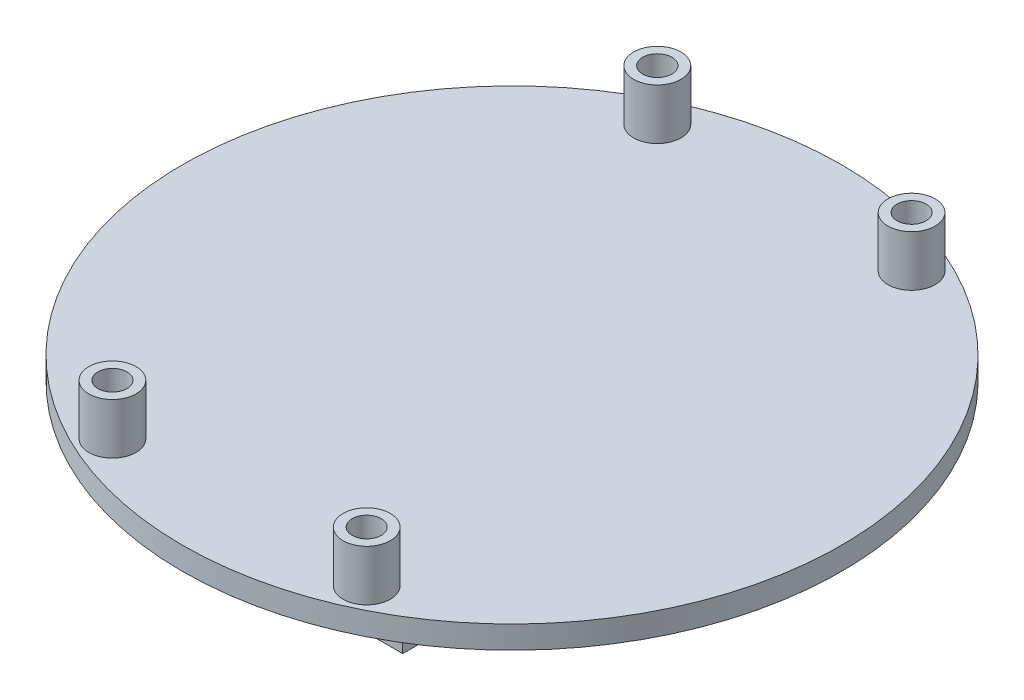
ISO-10303-21;
HEADER;
FILE_DESCRIPTION(('STEP AP214'),'2;1');
FILE_NAME('part.step','',(''),(''),'','','');
FILE_SCHEMA(('AUTOMOTIVE_DESIGN { 1 0 10303 214 1 1 1 1 }'));
ENDSEC;
DATA;
#1=APPLICATION_CONTEXT('core data for automotive mechanical design processes');
#2=APPLICATION_PROTOCOL_DEFINITION('international standard','automotive_design',2000,#1);
#3=PRODUCT_CONTEXT('',#1,'mechanical');
#4=PRODUCT('Part','Part','',(#3));
#5=PRODUCT_RELATED_PRODUCT_CATEGORY('part','',(#4));
#6=PRODUCT_DEFINITION_FORMATION('','',#4);
#7=PRODUCT_DEFINITION_CONTEXT('part definition',#1,'design');
#8=PRODUCT_DEFINITION('design','',#6,#7);
#9=PRODUCT_DEFINITION_SHAPE('','',#8);
#10=(LENGTH_UNIT() NAMED_UNIT(*) SI_UNIT(.MILLI.,.METRE.));
#11=(NAMED_UNIT(*) PLANE_ANGLE_UNIT() SI_UNIT($,.RADIAN.));
#12=(NAMED_UNIT(*) SI_UNIT($,.STERADIAN.) SOLID_ANGLE_UNIT());
#13=UNCERTAINTY_MEASURE_WITH_UNIT(LENGTH_MEASURE(1.E-05),#10,'distance_accuracy_value','');
#14=(GEOMETRIC_REPRESENTATION_CONTEXT(3) GLOBAL_UNCERTAINTY_ASSIGNED_CONTEXT((#13)) GLOBAL_UNIT_ASSIGNED_CONTEXT((#10,
#11,#12)) REPRESENTATION_CONTEXT('',''));
#15=CARTESIAN_POINT('',(0.,0.,0.));
#16=DIRECTION('',(0.,0.,1.));
#17=DIRECTION('',(1.,0.,0.));
#18=AXIS2_PLACEMENT_3D('',#15,#16,#17);
#19=CARTESIAN_POINT('',(0.,-1.25,0.));
#20=DIRECTION('',(0.,1.,0.));
#21=DIRECTION('',(0.,0.,1.));
#22=AXIS2_PLACEMENT_3D('',#19,#20,#21);
#23=PLANE('',#22);
#24=CARTESIAN_POINT('',(14.0000000003708,-1.25,-29.9999999995841));
#25=DIRECTION('',(0.,1.,0.));
#26=DIRECTION('',(0.,0.,1.));
#27=AXIS2_PLACEMENT_3D('',#24,#25,#26);
#28=CIRCLE('',#27,1.59999999976659);
#29=CARTESIAN_POINT('',(14.0000000003708,-1.25,-28.3999999998175));
#30=VERTEX_POINT('',#29);
#31=EDGE_CURVE('E48',#30,#30,#28,.T.);
#32=ORIENTED_EDGE('',*,*,#31,.T.);
#33=EDGE_LOOP('',(#32));
#34=FACE_BOUND('',#33,.T.);
#35=CARTESIAN_POINT('',(-14.0000000005569,-1.25,29.999999999983));
#36=DIRECTION('',(0.,1.,0.));
#37=DIRECTION('',(0.,0.,1.));
#38=AXIS2_PLACEMENT_3D('',#35,#36,#37);
#39=CIRCLE('',#38,1.60000000052716);
#40=CARTESIAN_POINT('',(-14.0000000005569,-1.25,31.6000000005101));
#41=VERTEX_POINT('',#40);
#42=EDGE_CURVE('E188',#41,#41,#39,.T.);
#43=ORIENTED_EDGE('',*,*,#42,.T.);
#44=EDGE_LOOP('',(#43));
#45=FACE_BOUND('',#44,.T.);
#46=CARTESIAN_POINT('',(13.9999999994432,-1.25,30.0000000004159));
#47=DIRECTION('',(0.,1.,0.));
#48=DIRECTION('',(0.,0.,1.));
#49=AXIS2_PLACEMENT_3D('',#46,#47,#48);
#50=CIRCLE('',#49,1.6000000006537);
#51=CARTESIAN_POINT('',(13.9999999994432,-1.25,31.6000000010696));
#52=VERTEX_POINT('',#51);
#53=EDGE_CURVE('E186',#52,#52,#50,.T.);
#54=ORIENTED_EDGE('',*,*,#53,.T.);
#55=EDGE_LOOP('',(#54));
#56=FACE_BOUND('',#55,.T.);
#57=CARTESIAN_POINT('',(-14.0000000000007,-1.25,-30.0000000000008));
#58=DIRECTION('',(0.,1.,0.));
#59=DIRECTION('',(0.,0.,1.));
#60=AXIS2_PLACEMENT_3D('',#57,#58,#59);
#61=CIRCLE('',#60,1.60731141973172);
#62=CARTESIAN_POINT('',(-14.0000000000007,-1.25,-28.3926885802691));
#63=VERTEX_POINT('',#62);
#64=EDGE_CURVE('E183',#63,#63,#61,.T.);
#65=ORIENTED_EDGE('',*,*,#64,.T.);
#66=EDGE_LOOP('',(#65));
#67=FACE_BOUND('',#66,.T.);
#68=CARTESIAN_POINT('',(0.,-1.25,0.));
#69=DIRECTION('',(0.,1.,0.));
#70=DIRECTION('',(0.,0.,1.));
#71=AXIS2_PLACEMENT_3D('',#68,#69,#70);
#72=CIRCLE('',#71,36.29);
#73=CARTESIAN_POINT('',(0.,-1.25,36.29));
#74=VERTEX_POINT('',#73);
#75=EDGE_CURVE('E53',#74,#74,#72,.T.);
#76=ORIENTED_EDGE('',*,*,#75,.F.);
#77=EDGE_LOOP('',(#76));
#78=FACE_BOUND('',#77,.T.);
#79=DIRECTION('',(0.,0.,-1.));
#80=VECTOR('',#79,1.);
#81=CARTESIAN_POINT('',(-14.97,-1.25,-27.005));
#82=LINE('',#81,#80);
#83=CARTESIAN_POINT('',(-14.97,-1.25,27.005));
#84=VERTEX_POINT('',#83);
#85=CARTESIAN_POINT('',(-14.97,-1.25,-27.005));
#86=VERTEX_POINT('',#85);
#87=EDGE_CURVE('E128',#84,#86,#82,.T.);
#88=ORIENTED_EDGE('',*,*,#87,.F.);
#89=DIRECTION('',(-1.,0.,0.));
#90=VECTOR('',#89,1.);
#91=CARTESIAN_POINT('',(-14.97,-1.25,27.005));
#92=LINE('',#91,#90);
#93=CARTESIAN_POINT('',(14.97,-1.25,27.005));
#94=VERTEX_POINT('',#93);
#95=EDGE_CURVE('E158',#94,#84,#92,.T.);
#96=ORIENTED_EDGE('',*,*,#95,.F.);
#97=DIRECTION('',(0.,0.,1.));
#98=VECTOR('',#97,1.);
#99=CARTESIAN_POINT('',(14.97,-1.25,-27.005));
#100=LINE('',#99,#98);
#101=CARTESIAN_POINT('',(14.97,-1.25,-27.005));
#102=VERTEX_POINT('',#101);
#103=EDGE_CURVE('E66',#102,#94,#100,.T.);
#104=ORIENTED_EDGE('',*,*,#103,.F.);
#105=DIRECTION('',(1.,0.,0.));
#106=VECTOR('',#105,1.);
#107=CARTESIAN_POINT('',(-14.97,-1.25,-27.005));
#108=LINE('',#107,#106);
#109=EDGE_CURVE('E61',#86,#102,#108,.T.);
#110=ORIENTED_EDGE('',*,*,#109,.F.);
#111=EDGE_LOOP('',(#88,#96,#104,#110));
#112=FACE_BOUND('',#111,.T.);
#113=ADVANCED_FACE('F44',(#34,#45,#56,#67,#78,#112),#23,.F.);
#114=CARTESIAN_POINT('',(0.,1.25,0.));
#115=DIRECTION('',(0.,-1.,0.));
#116=DIRECTION('',(0.,0.,-1.));
#117=AXIS2_PLACEMENT_3D('',#114,#115,#116);
#118=CYLINDRICAL_SURFACE('',#117,36.29);
#119=CARTESIAN_POINT('',(0.,1.25,0.));
#120=DIRECTION('',(0.,1.,0.));
#121=DIRECTION('',(0.,0.,1.));
#122=AXIS2_PLACEMENT_3D('',#119,#120,#121);
#123=CIRCLE('',#122,36.29);
#124=CARTESIAN_POINT('',(0.,1.25,36.29));
#125=VERTEX_POINT('',#124);
#126=EDGE_CURVE('E11',#125,#125,#123,.T.);
#127=ORIENTED_EDGE('',*,*,#126,.F.);
#128=EDGE_LOOP('',(#127));
#129=FACE_BOUND('',#128,.T.);
#130=ORIENTED_EDGE('',*,*,#75,.T.);
#131=EDGE_LOOP('',(#130));
#132=FACE_BOUND('',#131,.T.);
#133=ADVANCED_FACE('F46',(#129,#132),#118,.T.);
#134=CARTESIAN_POINT('',(0.,1.25,0.));
#135=DIRECTION('',(0.,1.,0.));
#136=DIRECTION('',(0.,0.,1.));
#137=AXIS2_PLACEMENT_3D('',#134,#135,#136);
#138=PLANE('',#137);
#139=CARTESIAN_POINT('',(13.9999999994432,1.25,30.0000000004159));
#140=DIRECTION('',(0.,1.,0.));
#141=DIRECTION('',(0.,0.,1.));
#142=AXIS2_PLACEMENT_3D('',#139,#140,#141);
#143=CIRCLE('',#142,2.60000000055617);
#144=CARTESIAN_POINT('',(13.9999999994432,1.25,32.6000000009721));
#145=VERTEX_POINT('',#144);
#146=EDGE_CURVE('E197',#145,#145,#143,.T.);
#147=ORIENTED_EDGE('',*,*,#146,.F.);
#148=EDGE_LOOP('',(#147));
#149=FACE_BOUND('',#148,.T.);
#150=CARTESIAN_POINT('',(-14.0000000005569,1.25,29.999999999983));
#151=DIRECTION('',(0.,1.,0.));
#152=DIRECTION('',(0.,0.,1.));
#153=AXIS2_PLACEMENT_3D('',#150,#151,#152);
#154=CIRCLE('',#153,2.6000000005562);
#155=CARTESIAN_POINT('',(-14.0000000005569,1.25,32.6000000005392));
#156=VERTEX_POINT('',#155);
#157=EDGE_CURVE('E208',#156,#156,#154,.T.);
#158=ORIENTED_EDGE('',*,*,#157,.F.);
#159=EDGE_LOOP('',(#158));
#160=FACE_BOUND('',#159,.T.);
#161=CARTESIAN_POINT('',(14.0000000003708,1.25,-29.9999999995841));
#162=DIRECTION('',(0.,1.,0.));
#163=DIRECTION('',(0.,0.,1.));
#164=AXIS2_PLACEMENT_3D('',#161,#162,#163);
#165=CIRCLE('',#164,2.59999999962852);
#166=CARTESIAN_POINT('',(14.0000000003708,1.25,-27.3999999999556));
#167=VERTEX_POINT('',#166);
#168=EDGE_CURVE('E217',#167,#167,#165,.T.);
#169=ORIENTED_EDGE('',*,*,#168,.F.);
#170=EDGE_LOOP('',(#169));
#171=FACE_BOUND('',#170,.T.);
#172=CARTESIAN_POINT('',(-14.0000000000007,1.25,-30.0000000000008));
#173=DIRECTION('',(0.,1.,0.));
#174=DIRECTION('',(0.,0.,1.));
#175=AXIS2_PLACEMENT_3D('',#172,#173,#174);
#176=CIRCLE('',#175,2.60731141973172);
#177=CARTESIAN_POINT('',(-14.0000000000007,1.25,-27.3926885802691));
#178=VERTEX_POINT('',#177);
#179=EDGE_CURVE('E228',#178,#178,#176,.T.);
#180=ORIENTED_EDGE('',*,*,#179,.F.);
#181=EDGE_LOOP('',(#180));
#182=FACE_BOUND('',#181,.T.);
#183=ORIENTED_EDGE('',*,*,#126,.T.);
#184=EDGE_LOOP('',(#183));
#185=FACE_BOUND('',#184,.T.);
#186=ADVANCED_FACE('F235',(#149,#160,#171,#182,#185),#138,.T.);
#187=CARTESIAN_POINT('',(0.,-6.25,0.));
#188=DIRECTION('',(0.,1.,0.));
#189=DIRECTION('',(0.,0.,1.));
#190=AXIS2_PLACEMENT_3D('',#187,#188,#189);
#191=PLANE('',#190);
#192=DIRECTION('',(0.,0.,-1.));
#193=VECTOR('',#192,1.);
#194=CARTESIAN_POINT('',(-14.97,-6.25,-27.005));
#195=LINE('',#194,#193);
#196=CARTESIAN_POINT('',(-14.97,-6.25,27.005));
#197=VERTEX_POINT('',#196);
#198=CARTESIAN_POINT('',(-14.97,-6.25,-27.005));
#199=VERTEX_POINT('',#198);
#200=EDGE_CURVE('E154',#197,#199,#195,.T.);
#201=ORIENTED_EDGE('',*,*,#200,.T.);
#202=DIRECTION('',(1.,0.,0.));
#203=VECTOR('',#202,1.);
#204=CARTESIAN_POINT('',(-14.97,-6.25,-27.005));
#205=LINE('',#204,#203);
#206=CARTESIAN_POINT('',(14.97,-6.25,-27.005));
#207=VERTEX_POINT('',#206);
#208=EDGE_CURVE('E157',#199,#207,#205,.T.);
#209=ORIENTED_EDGE('',*,*,#208,.T.);
#210=DIRECTION('',(0.,0.,1.));
#211=VECTOR('',#210,1.);
#212=CARTESIAN_POINT('',(14.97,-6.25,-27.005));
#213=LINE('',#212,#211);
#214=CARTESIAN_POINT('',(14.97,-6.25,27.005));
#215=VERTEX_POINT('',#214);
#216=EDGE_CURVE('E160',#207,#215,#213,.T.);
#217=ORIENTED_EDGE('',*,*,#216,.T.);
#218=DIRECTION('',(-1.,0.,0.));
#219=VECTOR('',#218,1.);
#220=CARTESIAN_POINT('',(-14.97,-6.25,27.005));
#221=LINE('',#220,#219);
#222=EDGE_CURVE('E162',#215,#197,#221,.T.);
#223=ORIENTED_EDGE('',*,*,#222,.T.);
#224=EDGE_LOOP('',(#201,#209,#217,#223));
#225=FACE_BOUND('',#224,.T.);
#226=DIRECTION('',(0.,0.,1.));
#227=VECTOR('',#226,1.);
#228=CARTESIAN_POINT('',(13.97,-6.25,-26.005));
#229=LINE('',#228,#227);
#230=CARTESIAN_POINT('',(13.97,-6.25,-26.005));
#231=VERTEX_POINT('',#230);
#232=CARTESIAN_POINT('',(13.97,-6.25,26.005));
#233=VERTEX_POINT('',#232);
#234=EDGE_CURVE('E110',#231,#233,#229,.T.);
#235=ORIENTED_EDGE('',*,*,#234,.F.);
#236=DIRECTION('',(1.,0.,0.));
#237=VECTOR('',#236,1.);
#238=CARTESIAN_POINT('',(-13.97,-6.25,-26.005));
#239=LINE('',#238,#237);
#240=CARTESIAN_POINT('',(-13.97,-6.25,-26.005));
#241=VERTEX_POINT('',#240);
#242=EDGE_CURVE('E136',#241,#231,#239,.T.);
#243=ORIENTED_EDGE('',*,*,#242,.F.);
#244=DIRECTION('',(0.,0.,-1.));
#245=VECTOR('',#244,1.);
#246=CARTESIAN_POINT('',(-13.97,-6.25,-26.005));
#247=LINE('',#246,#245);
#248=CARTESIAN_POINT('',(-13.97,-6.25,26.005));
#249=VERTEX_POINT('',#248);
#250=EDGE_CURVE('E134',#249,#241,#247,.T.);
#251=ORIENTED_EDGE('',*,*,#250,.F.);
#252=DIRECTION('',(-1.,0.,0.));
#253=VECTOR('',#252,1.);
#254=CARTESIAN_POINT('',(-13.97,-6.25,26.005));
#255=LINE('',#254,#253);
#256=EDGE_CURVE('E120',#233,#249,#255,.T.);
#257=ORIENTED_EDGE('',*,*,#256,.F.);
#258=EDGE_LOOP('',(#235,#243,#251,#257));
#259=FACE_BOUND('',#258,.T.);
#260=ADVANCED_FACE('F132',(#225,#259),#191,.F.);
#261=CARTESIAN_POINT('',(-14.97,-6.25,-27.005));
#262=DIRECTION('',(1.,0.,0.));
#263=DIRECTION('',(0.,0.,-1.));
#264=AXIS2_PLACEMENT_3D('',#261,#262,#263);
#265=PLANE('',#264);
#266=ORIENTED_EDGE('',*,*,#87,.T.);
#267=DIRECTION('',(0.,1.,0.));
#268=VECTOR('',#267,1.);
#269=CARTESIAN_POINT('',(-14.97,-6.25,-27.005));
#270=LINE('',#269,#268);
#271=EDGE_CURVE('E179',#199,#86,#270,.T.);
#272=ORIENTED_EDGE('',*,*,#271,.F.);
#273=ORIENTED_EDGE('',*,*,#200,.F.);
#274=DIRECTION('',(0.,1.,0.));
#275=VECTOR('',#274,1.);
#276=CARTESIAN_POINT('',(-14.97,-6.25,27.005));
#277=LINE('',#276,#275);
#278=EDGE_CURVE('E164',#197,#84,#277,.T.);
#279=ORIENTED_EDGE('',*,*,#278,.T.);
#280=EDGE_LOOP('',(#266,#272,#273,#279));
#281=FACE_BOUND('',#280,.T.);
#282=ADVANCED_FACE('F256',(#281),#265,.F.);
#283=CARTESIAN_POINT('',(-14.97,-6.25,-27.005));
#284=DIRECTION('',(0.,0.,1.));
#285=DIRECTION('',(1.,0.,0.));
#286=AXIS2_PLACEMENT_3D('',#283,#284,#285);
#287=PLANE('',#286);
#288=ORIENTED_EDGE('',*,*,#109,.T.);
#289=DIRECTION('',(0.,1.,0.));
#290=VECTOR('',#289,1.);
#291=CARTESIAN_POINT('',(14.97,-6.25,-27.005));
#292=LINE('',#291,#290);
#293=EDGE_CURVE('E176',#207,#102,#292,.T.);
#294=ORIENTED_EDGE('',*,*,#293,.F.);
#295=ORIENTED_EDGE('',*,*,#208,.F.);
#296=ORIENTED_EDGE('',*,*,#271,.T.);
#297=EDGE_LOOP('',(#288,#294,#295,#296));
#298=FACE_BOUND('',#297,.T.);
#299=ADVANCED_FACE('F263',(#298),#287,.F.);
#300=CARTESIAN_POINT('',(14.97,-6.25,-27.005));
#301=DIRECTION('',(-1.,0.,0.));
#302=DIRECTION('',(0.,0.,1.));
#303=AXIS2_PLACEMENT_3D('',#300,#301,#302);
#304=PLANE('',#303);
#305=ORIENTED_EDGE('',*,*,#103,.T.);
#306=DIRECTION('',(0.,1.,0.));
#307=VECTOR('',#306,1.);
#308=CARTESIAN_POINT('',(14.97,-6.25,27.005));
#309=LINE('',#308,#307);
#310=EDGE_CURVE('E173',#215,#94,#309,.T.);
#311=ORIENTED_EDGE('',*,*,#310,.F.);
#312=ORIENTED_EDGE('',*,*,#216,.F.);
#313=ORIENTED_EDGE('',*,*,#293,.T.);
#314=EDGE_LOOP('',(#305,#311,#312,#313));
#315=FACE_BOUND('',#314,.T.);
#316=ADVANCED_FACE('F261',(#315),#304,.F.);
#317=CARTESIAN_POINT('',(-14.97,-6.25,27.005));
#318=DIRECTION('',(0.,0.,-1.));
#319=DIRECTION('',(-1.,0.,0.));
#320=AXIS2_PLACEMENT_3D('',#317,#318,#319);
#321=PLANE('',#320);
#322=ORIENTED_EDGE('',*,*,#95,.T.);
#323=ORIENTED_EDGE('',*,*,#278,.F.);
#324=ORIENTED_EDGE('',*,*,#222,.F.);
#325=ORIENTED_EDGE('',*,*,#310,.T.);
#326=EDGE_LOOP('',(#322,#323,#324,#325));
#327=FACE_BOUND('',#326,.T.);
#328=ADVANCED_FACE('F252',(#327),#321,.F.);
#329=CARTESIAN_POINT('',(13.97,-6.25,-26.005));
#330=DIRECTION('',(-1.,0.,0.));
#331=DIRECTION('',(0.,0.,1.));
#332=AXIS2_PLACEMENT_3D('',#329,#330,#331);
#333=PLANE('',#332);
#334=DIRECTION('',(0.,0.,1.));
#335=VECTOR('',#334,1.);
#336=CARTESIAN_POINT('',(13.97,-1.25,-26.005));
#337=LINE('',#336,#335);
#338=CARTESIAN_POINT('',(13.97,-1.25,-26.005));
#339=VERTEX_POINT('',#338);
#340=CARTESIAN_POINT('',(13.97,-1.25,26.005));
#341=VERTEX_POINT('',#340);
#342=EDGE_CURVE('E141',#339,#341,#337,.T.);
#343=ORIENTED_EDGE('',*,*,#342,.F.);
#344=DIRECTION('',(0.,1.,0.));
#345=VECTOR('',#344,1.);
#346=CARTESIAN_POINT('',(13.97,-6.25,-26.005));
#347=LINE('',#346,#345);
#348=EDGE_CURVE('E116',#231,#339,#347,.T.);
#349=ORIENTED_EDGE('',*,*,#348,.F.);
#350=ORIENTED_EDGE('',*,*,#234,.T.);
#351=DIRECTION('',(0.,1.,0.));
#352=VECTOR('',#351,1.);
#353=CARTESIAN_POINT('',(13.97,-6.25,26.005));
#354=LINE('',#353,#352);
#355=EDGE_CURVE('E114',#233,#341,#354,.T.);
#356=ORIENTED_EDGE('',*,*,#355,.T.);
#357=EDGE_LOOP('',(#343,#349,#350,#356));
#358=FACE_BOUND('',#357,.T.);
#359=ADVANCED_FACE('F113',(#358),#333,.T.);
#360=CARTESIAN_POINT('',(-13.97,-6.25,26.005));
#361=DIRECTION('',(0.,0.,-1.));
#362=DIRECTION('',(-1.,0.,0.));
#363=AXIS2_PLACEMENT_3D('',#360,#361,#362);
#364=PLANE('',#363);
#365=DIRECTION('',(-1.,0.,0.));
#366=VECTOR('',#365,1.);
#367=CARTESIAN_POINT('',(-13.97,-1.25,26.005));
#368=LINE('',#367,#366);
#369=CARTESIAN_POINT('',(-13.97,-1.25,26.005));
#370=VERTEX_POINT('',#369);
#371=EDGE_CURVE('E127',#341,#370,#368,.T.);
#372=ORIENTED_EDGE('',*,*,#371,.F.);
#373=ORIENTED_EDGE('',*,*,#355,.F.);
#374=ORIENTED_EDGE('',*,*,#256,.T.);
#375=DIRECTION('',(0.,1.,0.));
#376=VECTOR('',#375,1.);
#377=CARTESIAN_POINT('',(-13.97,-6.25,26.005));
#378=LINE('',#377,#376);
#379=EDGE_CURVE('E129',#249,#370,#378,.T.);
#380=ORIENTED_EDGE('',*,*,#379,.T.);
#381=EDGE_LOOP('',(#372,#373,#374,#380));
#382=FACE_BOUND('',#381,.T.);
#383=ADVANCED_FACE('F124',(#382),#364,.T.);
#384=CARTESIAN_POINT('',(-13.97,-6.25,-26.005));
#385=DIRECTION('',(1.,0.,0.));
#386=DIRECTION('',(0.,0.,-1.));
#387=AXIS2_PLACEMENT_3D('',#384,#385,#386);
#388=PLANE('',#387);
#389=DIRECTION('',(0.,0.,-1.));
#390=VECTOR('',#389,1.);
#391=CARTESIAN_POINT('',(-13.97,-1.25,-26.005));
#392=LINE('',#391,#390);
#393=CARTESIAN_POINT('',(-13.97,-1.25,-26.005));
#394=VERTEX_POINT('',#393);
#395=EDGE_CURVE('E145',#370,#394,#392,.T.);
#396=ORIENTED_EDGE('',*,*,#395,.F.);
#397=ORIENTED_EDGE('',*,*,#379,.F.);
#398=ORIENTED_EDGE('',*,*,#250,.T.);
#399=DIRECTION('',(0.,1.,0.));
#400=VECTOR('',#399,1.);
#401=CARTESIAN_POINT('',(-13.97,-6.25,-26.005));
#402=LINE('',#401,#400);
#403=EDGE_CURVE('E151',#241,#394,#402,.T.);
#404=ORIENTED_EDGE('',*,*,#403,.T.);
#405=EDGE_LOOP('',(#396,#397,#398,#404));
#406=FACE_BOUND('',#405,.T.);
#407=ADVANCED_FACE('F283',(#406),#388,.T.);
#408=CARTESIAN_POINT('',(-13.97,-6.25,-26.005));
#409=DIRECTION('',(0.,0.,1.));
#410=DIRECTION('',(1.,0.,0.));
#411=AXIS2_PLACEMENT_3D('',#408,#409,#410);
#412=PLANE('',#411);
#413=DIRECTION('',(1.,0.,0.));
#414=VECTOR('',#413,1.);
#415=CARTESIAN_POINT('',(-13.97,-1.25,-26.005));
#416=LINE('',#415,#414);
#417=EDGE_CURVE('E121',#394,#339,#416,.T.);
#418=ORIENTED_EDGE('',*,*,#417,.F.);
#419=ORIENTED_EDGE('',*,*,#403,.F.);
#420=ORIENTED_EDGE('',*,*,#242,.T.);
#421=ORIENTED_EDGE('',*,*,#348,.T.);
#422=EDGE_LOOP('',(#418,#419,#420,#421));
#423=FACE_BOUND('',#422,.T.);
#424=ADVANCED_FACE('F275',(#423),#412,.T.);
#425=ORIENTED_EDGE('',*,*,#417,.T.);
#426=ORIENTED_EDGE('',*,*,#342,.T.);
#427=ORIENTED_EDGE('',*,*,#371,.T.);
#428=ORIENTED_EDGE('',*,*,#395,.T.);
#429=EDGE_LOOP('',(#425,#426,#427,#428));
#430=FACE_BOUND('',#429,.T.);
#431=ADVANCED_FACE('F247',(#430),#23,.F.);
#432=CARTESIAN_POINT('',(-14.0000000000007,6.84,-30.0000000000008));
#433=DIRECTION('',(0.,1.,0.));
#434=DIRECTION('',(0.,0.,1.));
#435=AXIS2_PLACEMENT_3D('',#432,#433,#434);
#436=PLANE('',#435);
#437=CARTESIAN_POINT('',(-14.0000000000007,6.84,-30.0000000000008));
#438=DIRECTION('',(0.,1.,0.));
#439=DIRECTION('',(0.,0.,1.));
#440=AXIS2_PLACEMENT_3D('',#437,#438,#439);
#441=CIRCLE('',#440,2.60731141973172);
#442=CARTESIAN_POINT('',(-14.0000000000007,6.84,-27.3926885802691));
#443=VERTEX_POINT('',#442);
#444=EDGE_CURVE('E143',#443,#443,#441,.T.);
#445=ORIENTED_EDGE('',*,*,#444,.T.);
#446=EDGE_LOOP('',(#445));
#447=FACE_BOUND('',#446,.T.);
#448=CARTESIAN_POINT('',(-14.0000000000007,6.84,-30.0000000000008));
#449=DIRECTION('',(0.,1.,0.));
#450=DIRECTION('',(0.,0.,1.));
#451=AXIS2_PLACEMENT_3D('',#448,#449,#450);
#452=CIRCLE('',#451,1.60731141973172);
#453=CARTESIAN_POINT('',(-14.0000000000007,6.84,-28.3926885802691));
#454=VERTEX_POINT('',#453);
#455=EDGE_CURVE('E225',#454,#454,#452,.T.);
#456=ORIENTED_EDGE('',*,*,#455,.F.);
#457=EDGE_LOOP('',(#456));
#458=FACE_BOUND('',#457,.T.);
#459=ADVANCED_FACE('F274',(#447,#458),#436,.T.);
#460=CARTESIAN_POINT('',(-14.0000000000007,6.84,-30.0000000000008));
#461=DIRECTION('',(0.,-1.,0.));
#462=DIRECTION('',(0.,0.,-1.));
#463=AXIS2_PLACEMENT_3D('',#460,#461,#462);
#464=CYLINDRICAL_SURFACE('',#463,2.60731141973172);
#465=ORIENTED_EDGE('',*,*,#444,.F.);
#466=EDGE_LOOP('',(#465));
#467=FACE_BOUND('',#466,.T.);
#468=ORIENTED_EDGE('',*,*,#179,.T.);
#469=EDGE_LOOP('',(#468));
#470=FACE_BOUND('',#469,.T.);
#471=ADVANCED_FACE('F233',(#467,#470),#464,.T.);
#472=CARTESIAN_POINT('',(-14.0000000000007,6.84,-30.0000000000008));
#473=DIRECTION('',(0.,-1.,0.));
#474=DIRECTION('',(0.,0.,-1.));
#475=AXIS2_PLACEMENT_3D('',#472,#473,#474);
#476=CYLINDRICAL_SURFACE('',#475,1.60731141973172);
#477=ORIENTED_EDGE('',*,*,#455,.T.);
#478=EDGE_LOOP('',(#477));
#479=FACE_BOUND('',#478,.T.);
#480=ORIENTED_EDGE('',*,*,#64,.F.);
#481=EDGE_LOOP('',(#480));
#482=FACE_BOUND('',#481,.T.);
#483=ADVANCED_FACE('F341',(#479,#482),#476,.F.);
#484=CARTESIAN_POINT('',(14.0000000003708,6.84,-29.9999999995841));
#485=DIRECTION('',(0.,1.,0.));
#486=DIRECTION('',(0.,0.,1.));
#487=AXIS2_PLACEMENT_3D('',#484,#485,#486);
#488=PLANE('',#487);
#489=CARTESIAN_POINT('',(14.0000000003708,6.84,-29.9999999995841));
#490=DIRECTION('',(0.,1.,0.));
#491=DIRECTION('',(0.,0.,1.));
#492=AXIS2_PLACEMENT_3D('',#489,#490,#491);
#493=CIRCLE('',#492,2.59999999962852);
#494=CARTESIAN_POINT('',(14.0000000003708,6.84,-27.3999999999556));
#495=VERTEX_POINT('',#494);
#496=EDGE_CURVE('E216',#495,#495,#493,.T.);
#497=ORIENTED_EDGE('',*,*,#496,.T.);
#498=EDGE_LOOP('',(#497));
#499=FACE_BOUND('',#498,.T.);
#500=CARTESIAN_POINT('',(14.0000000003708,6.84,-29.9999999995841));
#501=DIRECTION('',(0.,1.,0.));
#502=DIRECTION('',(0.,0.,1.));
#503=AXIS2_PLACEMENT_3D('',#500,#501,#502);
#504=CIRCLE('',#503,1.59999999976659);
#505=CARTESIAN_POINT('',(14.0000000003708,6.84,-28.3999999998175));
#506=VERTEX_POINT('',#505);
#507=EDGE_CURVE('E220',#506,#506,#504,.T.);
#508=ORIENTED_EDGE('',*,*,#507,.F.);
#509=EDGE_LOOP('',(#508));
#510=FACE_BOUND('',#509,.T.);
#511=ADVANCED_FACE('F352',(#499,#510),#488,.T.);
#512=CARTESIAN_POINT('',(14.0000000003708,6.84,-29.9999999995841));
#513=DIRECTION('',(0.,-1.,0.));
#514=DIRECTION('',(0.,0.,-1.));
#515=AXIS2_PLACEMENT_3D('',#512,#513,#514);
#516=CYLINDRICAL_SURFACE('',#515,2.59999999962852);
#517=ORIENTED_EDGE('',*,*,#496,.F.);
#518=EDGE_LOOP('',(#517));
#519=FACE_BOUND('',#518,.T.);
#520=ORIENTED_EDGE('',*,*,#168,.T.);
#521=EDGE_LOOP('',(#520));
#522=FACE_BOUND('',#521,.T.);
#523=ADVANCED_FACE('F364',(#519,#522),#516,.T.);
#524=CARTESIAN_POINT('',(14.0000000003708,6.84,-29.9999999995841));
#525=DIRECTION('',(0.,-1.,0.));
#526=DIRECTION('',(0.,0.,-1.));
#527=AXIS2_PLACEMENT_3D('',#524,#525,#526);
#528=CYLINDRICAL_SURFACE('',#527,1.59999999976659);
#529=ORIENTED_EDGE('',*,*,#507,.T.);
#530=EDGE_LOOP('',(#529));
#531=FACE_BOUND('',#530,.T.);
#532=ORIENTED_EDGE('',*,*,#31,.F.);
#533=EDGE_LOOP('',(#532));
#534=FACE_BOUND('',#533,.T.);
#535=ADVANCED_FACE('F374',(#531,#534),#528,.F.);
#536=CARTESIAN_POINT('',(-14.0000000005569,6.84,29.999999999983));
#537=DIRECTION('',(0.,1.,0.));
#538=DIRECTION('',(0.,0.,1.));
#539=AXIS2_PLACEMENT_3D('',#536,#537,#538);
#540=PLANE('',#539);
#541=CARTESIAN_POINT('',(-14.0000000005569,6.84,29.999999999983));
#542=DIRECTION('',(0.,1.,0.));
#543=DIRECTION('',(0.,0.,1.));
#544=AXIS2_PLACEMENT_3D('',#541,#542,#543);
#545=CIRCLE('',#544,2.6000000005562);
#546=CARTESIAN_POINT('',(-14.0000000005569,6.84,32.6000000005392));
#547=VERTEX_POINT('',#546);
#548=EDGE_CURVE('E207',#547,#547,#545,.T.);
#549=ORIENTED_EDGE('',*,*,#548,.T.);
#550=EDGE_LOOP('',(#549));
#551=FACE_BOUND('',#550,.T.);
#552=CARTESIAN_POINT('',(-14.0000000005569,6.84,29.999999999983));
#553=DIRECTION('',(0.,1.,0.));
#554=DIRECTION('',(0.,0.,1.));
#555=AXIS2_PLACEMENT_3D('',#552,#553,#554);
#556=CIRCLE('',#555,1.60000000052716);
#557=CARTESIAN_POINT('',(-14.0000000005569,6.84,31.6000000005101));
#558=VERTEX_POINT('',#557);
#559=EDGE_CURVE('E211',#558,#558,#556,.T.);
#560=ORIENTED_EDGE('',*,*,#559,.F.);
#561=EDGE_LOOP('',(#560));
#562=FACE_BOUND('',#561,.T.);
#563=ADVANCED_FACE('F385',(#551,#562),#540,.T.);
#564=CARTESIAN_POINT('',(-14.0000000005569,6.84,29.999999999983));
#565=DIRECTION('',(0.,-1.,0.));
#566=DIRECTION('',(0.,0.,-1.));
#567=AXIS2_PLACEMENT_3D('',#564,#565,#566);
#568=CYLINDRICAL_SURFACE('',#567,2.6000000005562);
#569=ORIENTED_EDGE('',*,*,#548,.F.);
#570=EDGE_LOOP('',(#569));
#571=FACE_BOUND('',#570,.T.);
#572=ORIENTED_EDGE('',*,*,#157,.T.);
#573=EDGE_LOOP('',(#572));
#574=FACE_BOUND('',#573,.T.);
#575=ADVANCED_FACE('F396',(#571,#574),#568,.T.);
#576=CARTESIAN_POINT('',(-14.0000000005569,6.84,29.999999999983));
#577=DIRECTION('',(0.,-1.,0.));
#578=DIRECTION('',(0.,0.,-1.));
#579=AXIS2_PLACEMENT_3D('',#576,#577,#578);
#580=CYLINDRICAL_SURFACE('',#579,1.60000000052716);
#581=ORIENTED_EDGE('',*,*,#559,.T.);
#582=EDGE_LOOP('',(#581));
#583=FACE_BOUND('',#582,.T.);
#584=ORIENTED_EDGE('',*,*,#42,.F.);
#585=EDGE_LOOP('',(#584));
#586=FACE_BOUND('',#585,.T.);
#587=ADVANCED_FACE('F406',(#583,#586),#580,.F.);
#588=CARTESIAN_POINT('',(13.9999999994432,6.84,30.0000000004159));
#589=DIRECTION('',(0.,1.,0.));
#590=DIRECTION('',(0.,0.,1.));
#591=AXIS2_PLACEMENT_3D('',#588,#589,#590);
#592=PLANE('',#591);
#593=CARTESIAN_POINT('',(13.9999999994432,6.84,30.0000000004159));
#594=DIRECTION('',(0.,1.,0.));
#595=DIRECTION('',(0.,0.,1.));
#596=AXIS2_PLACEMENT_3D('',#593,#594,#595);
#597=CIRCLE('',#596,2.60000000055617);
#598=CARTESIAN_POINT('',(13.9999999994432,6.84,32.6000000009721));
#599=VERTEX_POINT('',#598);
#600=EDGE_CURVE('E193',#599,#599,#597,.T.);
#601=ORIENTED_EDGE('',*,*,#600,.T.);
#602=EDGE_LOOP('',(#601));
#603=FACE_BOUND('',#602,.T.);
#604=CARTESIAN_POINT('',(13.9999999994432,6.84,30.0000000004159));
#605=DIRECTION('',(0.,1.,0.));
#606=DIRECTION('',(0.,0.,1.));
#607=AXIS2_PLACEMENT_3D('',#604,#605,#606);
#608=CIRCLE('',#607,1.6000000006537);
#609=CARTESIAN_POINT('',(13.9999999994432,6.84,31.6000000010696));
#610=VERTEX_POINT('',#609);
#611=EDGE_CURVE('E202',#610,#610,#608,.T.);
#612=ORIENTED_EDGE('',*,*,#611,.F.);
#613=EDGE_LOOP('',(#612));
#614=FACE_BOUND('',#613,.T.);
#615=ADVANCED_FACE('F417',(#603,#614),#592,.T.);
#616=CARTESIAN_POINT('',(13.9999999994432,6.84,30.0000000004159));
#617=DIRECTION('',(0.,-1.,0.));
#618=DIRECTION('',(0.,0.,-1.));
#619=AXIS2_PLACEMENT_3D('',#616,#617,#618);
#620=CYLINDRICAL_SURFACE('',#619,2.60000000055617);
#621=ORIENTED_EDGE('',*,*,#600,.F.);
#622=EDGE_LOOP('',(#621));
#623=FACE_BOUND('',#622,.T.);
#624=ORIENTED_EDGE('',*,*,#146,.T.);
#625=EDGE_LOOP('',(#624));
#626=FACE_BOUND('',#625,.T.);
#627=ADVANCED_FACE('F428',(#623,#626),#620,.T.);
#628=CARTESIAN_POINT('',(13.9999999994432,6.84,30.0000000004159));
#629=DIRECTION('',(0.,-1.,0.));
#630=DIRECTION('',(0.,0.,-1.));
#631=AXIS2_PLACEMENT_3D('',#628,#629,#630);
#632=CYLINDRICAL_SURFACE('',#631,1.6000000006537);
#633=ORIENTED_EDGE('',*,*,#611,.T.);
#634=EDGE_LOOP('',(#633));
#635=FACE_BOUND('',#634,.T.);
#636=ORIENTED_EDGE('',*,*,#53,.F.);
#637=EDGE_LOOP('',(#636));
#638=FACE_BOUND('',#637,.T.);
#639=ADVANCED_FACE('F436',(#635,#638),#632,.F.);
#640=CLOSED_SHELL('',(#113,#133,#186,#260,#282,#299,#316,#328,#359,#383,#407,#424,#431,#459,
#471,#483,#511,#523,#535,#563,#575,#587,#615,#627,#639));
#641=MANIFOLD_SOLID_BREP('B2',#640);
#642=ADVANCED_BREP_SHAPE_REPRESENTATION('',(#18,#641),#14);
#643=SHAPE_DEFINITION_REPRESENTATION(#9,#642);
ENDSEC;
END-ISO-10303-21;
